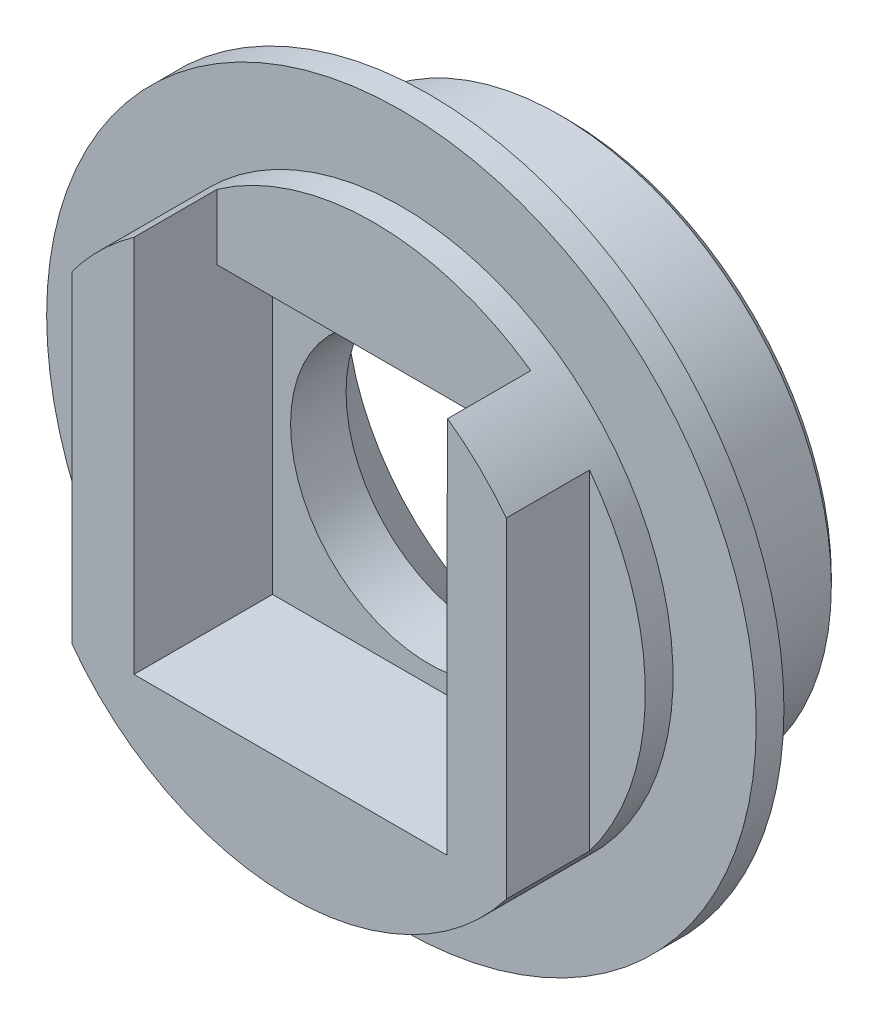
ISO-10303-21;
HEADER;
FILE_DESCRIPTION(('STEP AP214'),'2;1');
FILE_NAME('part.step','',(''),(''),'','','');
FILE_SCHEMA(('AUTOMOTIVE_DESIGN { 1 0 10303 214 1 1 1 1 }'));
ENDSEC;
DATA;
#1=APPLICATION_CONTEXT('core data for automotive mechanical design processes');
#2=APPLICATION_PROTOCOL_DEFINITION('international standard','automotive_design',2000,#1);
#3=PRODUCT_CONTEXT('',#1,'mechanical');
#4=PRODUCT('Part','Part','',(#3));
#5=PRODUCT_RELATED_PRODUCT_CATEGORY('part','',(#4));
#6=PRODUCT_DEFINITION_FORMATION('','',#4);
#7=PRODUCT_DEFINITION_CONTEXT('part definition',#1,'design');
#8=PRODUCT_DEFINITION('design','',#6,#7);
#9=PRODUCT_DEFINITION_SHAPE('','',#8);
#10=(LENGTH_UNIT() NAMED_UNIT(*) SI_UNIT(.MILLI.,.METRE.));
#11=(NAMED_UNIT(*) PLANE_ANGLE_UNIT() SI_UNIT($,.RADIAN.));
#12=(NAMED_UNIT(*) SI_UNIT($,.STERADIAN.) SOLID_ANGLE_UNIT());
#13=UNCERTAINTY_MEASURE_WITH_UNIT(LENGTH_MEASURE(1.E-05),#10,'distance_accuracy_value','');
#14=(GEOMETRIC_REPRESENTATION_CONTEXT(3) GLOBAL_UNCERTAINTY_ASSIGNED_CONTEXT((#13)) GLOBAL_UNIT_ASSIGNED_CONTEXT((#10,
#11,#12)) REPRESENTATION_CONTEXT('',''));
#15=CARTESIAN_POINT('',(0.,0.,0.));
#16=DIRECTION('',(0.,0.,1.));
#17=DIRECTION('',(1.,0.,0.));
#18=AXIS2_PLACEMENT_3D('',#15,#16,#17);
#19=CARTESIAN_POINT('',(0.,0.,10.));
#20=DIRECTION('',(0.,0.,-1.));
#21=DIRECTION('',(-1.,0.,0.));
#22=AXIS2_PLACEMENT_3D('',#19,#20,#21);
#23=CYLINDRICAL_SURFACE('',#22,9.8);
#24=CARTESIAN_POINT('',(0.,0.,10.));
#25=DIRECTION('',(0.,0.,1.));
#26=DIRECTION('',(1.,0.,0.));
#27=AXIS2_PLACEMENT_3D('',#24,#25,#26);
#28=CIRCLE('',#27,9.8);
#29=CARTESIAN_POINT('',(-7.8873957083092,-5.81626933184371,10.));
#30=VERTEX_POINT('',#29);
#31=CARTESIAN_POINT('',(7.78395445311825,-5.95399471546462,10.));
#32=VERTEX_POINT('',#31);
#33=EDGE_CURVE('E147',#30,#32,#28,.T.);
#34=ORIENTED_EDGE('',*,*,#33,.F.);
#35=DIRECTION('',(0.,0.,-1.));
#36=VECTOR('',#35,1.);
#37=CARTESIAN_POINT('',(-7.8873957083092,-5.81626933184371,10.));
#38=LINE('',#37,#36);
#39=CARTESIAN_POINT('',(-7.8873957083092,-5.81626933184371,7.));
#40=VERTEX_POINT('',#39);
#41=EDGE_CURVE('E180',#30,#40,#38,.T.);
#42=ORIENTED_EDGE('',*,*,#41,.T.);
#43=CARTESIAN_POINT('',(0.,0.,7.));
#44=DIRECTION('',(0.,0.,1.));
#45=DIRECTION('',(1.,0.,0.));
#46=AXIS2_PLACEMENT_3D('',#43,#44,#45);
#47=CIRCLE('',#46,9.8);
#48=CARTESIAN_POINT('',(-7.8873957083092,5.81626933184371,7.));
#49=VERTEX_POINT('',#48);
#50=EDGE_CURVE('E132',#49,#40,#47,.T.);
#51=ORIENTED_EDGE('',*,*,#50,.F.);
#52=DIRECTION('',(0.,0.,-1.));
#53=VECTOR('',#52,1.);
#54=CARTESIAN_POINT('',(-7.8873957083092,5.81626933184371,10.));
#55=LINE('',#54,#53);
#56=CARTESIAN_POINT('',(-7.8873957083092,5.81626933184371,10.));
#57=VERTEX_POINT('',#56);
#58=EDGE_CURVE('E172',#49,#57,#55,.F.);
#59=ORIENTED_EDGE('',*,*,#58,.T.);
#60=CARTESIAN_POINT('',(-5.65,8.00734038242412,10.));
#61=VERTEX_POINT('',#60);
#62=EDGE_CURVE('E156',#61,#57,#28,.T.);
#63=ORIENTED_EDGE('',*,*,#62,.F.);
#64=DIRECTION('',(0.,0.,-1.));
#65=VECTOR('',#64,1.);
#66=CARTESIAN_POINT('',(-5.65,8.00734038242412,10.));
#67=LINE('',#66,#65);
#68=CARTESIAN_POINT('',(-5.65,8.00734038242412,7.));
#69=VERTEX_POINT('',#68);
#70=EDGE_CURVE('E168',#61,#69,#67,.T.);
#71=ORIENTED_EDGE('',*,*,#70,.T.);
#72=CARTESIAN_POINT('',(0.,0.,7.));
#73=DIRECTION('',(0.,0.,-1.));
#74=DIRECTION('',(-1.,0.,0.));
#75=AXIS2_PLACEMENT_3D('',#72,#73,#74);
#76=CIRCLE('',#75,9.8);
#77=CARTESIAN_POINT('',(5.66340872170398,7.99786231757758,7.));
#78=VERTEX_POINT('',#77);
#79=EDGE_CURVE('E162',#69,#78,#76,.T.);
#80=ORIENTED_EDGE('',*,*,#79,.T.);
#81=DIRECTION('',(0.,0.,-1.));
#82=VECTOR('',#81,1.);
#83=CARTESIAN_POINT('',(5.66340872170398,7.99786231757758,10.));
#84=LINE('',#83,#82);
#85=CARTESIAN_POINT('',(5.66340872170398,7.99786231757758,10.));
#86=VERTEX_POINT('',#85);
#87=EDGE_CURVE('E151',#78,#86,#84,.F.);
#88=ORIENTED_EDGE('',*,*,#87,.T.);
#89=CARTESIAN_POINT('',(7.78395445311825,5.95399471546462,10.));
#90=VERTEX_POINT('',#89);
#91=EDGE_CURVE('E141',#90,#86,#28,.T.);
#92=ORIENTED_EDGE('',*,*,#91,.F.);
#93=DIRECTION('',(0.,0.,-1.));
#94=VECTOR('',#93,1.);
#95=CARTESIAN_POINT('',(7.78395445311825,5.95399471546462,10.));
#96=LINE('',#95,#94);
#97=CARTESIAN_POINT('',(7.78395445311825,5.95399471546462,7.));
#98=VERTEX_POINT('',#97);
#99=EDGE_CURVE('E130',#90,#98,#96,.T.);
#100=ORIENTED_EDGE('',*,*,#99,.T.);
#101=CARTESIAN_POINT('',(0.,0.,7.));
#102=DIRECTION('',(0.,0.,-1.));
#103=DIRECTION('',(-1.,0.,0.));
#104=AXIS2_PLACEMENT_3D('',#101,#102,#103);
#105=CIRCLE('',#104,9.8);
#106=CARTESIAN_POINT('',(7.78395445311825,-5.95399471546462,7.));
#107=VERTEX_POINT('',#106);
#108=EDGE_CURVE('E167',#98,#107,#105,.T.);
#109=ORIENTED_EDGE('',*,*,#108,.T.);
#110=DIRECTION('',(0.,0.,-1.));
#111=VECTOR('',#110,1.);
#112=CARTESIAN_POINT('',(7.78395445311825,-5.95399471546462,10.));
#113=LINE('',#112,#111);
#114=EDGE_CURVE('E136',#107,#32,#113,.F.);
#115=ORIENTED_EDGE('',*,*,#114,.T.);
#116=EDGE_LOOP('',(#34,#42,#51,#59,#63,#71,#80,#88,#92,#100,#109,#115));
#117=FACE_BOUND('',#116,.T.);
#118=CARTESIAN_POINT('',(0.,0.,6.));
#119=DIRECTION('',(0.,0.,-1.));
#120=DIRECTION('',(-1.,0.,0.));
#121=AXIS2_PLACEMENT_3D('',#118,#119,#120);
#122=CIRCLE('',#121,9.8);
#123=CARTESIAN_POINT('',(-9.8,0.,6.));
#124=VERTEX_POINT('',#123);
#125=EDGE_CURVE('E11',#124,#124,#122,.T.);
#126=ORIENTED_EDGE('',*,*,#125,.F.);
#127=EDGE_LOOP('',(#126));
#128=FACE_BOUND('',#127,.T.);
#129=ADVANCED_FACE('F41',(#117,#128),#23,.T.);
#130=CARTESIAN_POINT('',(-5.65,5.65,5.));
#131=DIRECTION('',(0.,1.,0.));
#132=DIRECTION('',(0.,0.,1.));
#133=AXIS2_PLACEMENT_3D('',#130,#131,#132);
#134=PLANE('',#133);
#135=DIRECTION('',(1.,0.,0.));
#136=VECTOR('',#135,1.);
#137=CARTESIAN_POINT('',(-5.65,5.65,7.));
#138=LINE('',#137,#136);
#139=CARTESIAN_POINT('',(-5.65,5.65,7.));
#140=VERTEX_POINT('',#139);
#141=CARTESIAN_POINT('',(5.65,5.65,7.));
#142=VERTEX_POINT('',#141);
#143=EDGE_CURVE('E398',#140,#142,#138,.T.);
#144=ORIENTED_EDGE('',*,*,#143,.F.);
#145=DIRECTION('',(0.,0.,1.));
#146=VECTOR('',#145,1.);
#147=CARTESIAN_POINT('',(-5.65,5.65,5.));
#148=LINE('',#147,#146);
#149=CARTESIAN_POINT('',(-5.65,5.65,5.));
#150=VERTEX_POINT('',#149);
#151=EDGE_CURVE('E157',#150,#140,#148,.T.);
#152=ORIENTED_EDGE('',*,*,#151,.F.);
#153=DIRECTION('',(-1.,0.,0.));
#154=VECTOR('',#153,1.);
#155=CARTESIAN_POINT('',(-5.65,5.65,5.));
#156=LINE('',#155,#154);
#157=CARTESIAN_POINT('',(5.65,5.65,5.));
#158=VERTEX_POINT('',#157);
#159=EDGE_CURVE('E381',#158,#150,#156,.T.);
#160=ORIENTED_EDGE('',*,*,#159,.F.);
#161=DIRECTION('',(0.,0.,1.));
#162=VECTOR('',#161,1.);
#163=CARTESIAN_POINT('',(5.65,5.65,5.));
#164=LINE('',#163,#162);
#165=EDGE_CURVE('E359',#158,#142,#164,.T.);
#166=ORIENTED_EDGE('',*,*,#165,.T.);
#167=EDGE_LOOP('',(#144,#152,#160,#166));
#168=FACE_BOUND('',#167,.T.);
#169=ADVANCED_FACE('F218',(#168),#134,.F.);
#170=CARTESIAN_POINT('',(0.,0.,10.));
#171=DIRECTION('',(0.,0.,-1.));
#172=DIRECTION('',(-1.,0.,0.));
#173=AXIS2_PLACEMENT_3D('',#170,#171,#172);
#174=CYLINDRICAL_SURFACE('',#173,5.);
#175=CARTESIAN_POINT('',(0.,0.,3.00000000000001));
#176=DIRECTION('',(0.,0.,1.));
#177=DIRECTION('',(1.,0.,0.));
#178=AXIS2_PLACEMENT_3D('',#175,#176,#177);
#179=CIRCLE('',#178,5.);
#180=CARTESIAN_POINT('',(5.,0.,3.00000000000001));
#181=VERTEX_POINT('',#180);
#182=EDGE_CURVE('E182',#181,#181,#179,.F.);
#183=ORIENTED_EDGE('',*,*,#182,.T.);
#184=EDGE_LOOP('',(#183));
#185=FACE_BOUND('',#184,.T.);
#186=CARTESIAN_POINT('',(0.,0.,5.));
#187=DIRECTION('',(0.,0.,1.));
#188=DIRECTION('',(1.,0.,0.));
#189=AXIS2_PLACEMENT_3D('',#186,#187,#188);
#190=CIRCLE('',#189,5.);
#191=CARTESIAN_POINT('',(5.,0.,5.));
#192=VERTEX_POINT('',#191);
#193=EDGE_CURVE('E154',#192,#192,#190,.T.);
#194=ORIENTED_EDGE('',*,*,#193,.T.);
#195=EDGE_LOOP('',(#194));
#196=FACE_BOUND('',#195,.T.);
#197=ADVANCED_FACE('F217',(#185,#196),#174,.F.);
#198=CARTESIAN_POINT('',(0.,0.,10.));
#199=DIRECTION('',(0.,0.,1.));
#200=DIRECTION('',(1.,0.,0.));
#201=AXIS2_PLACEMENT_3D('',#198,#199,#200);
#202=PLANE('',#201);
#203=DIRECTION('',(0.,1.,0.));
#204=VECTOR('',#203,1.);
#205=CARTESIAN_POINT('',(-7.8873957083092,9.03817967230844,10.));
#206=LINE('',#205,#204);
#207=EDGE_CURVE('E150',#30,#57,#206,.T.);
#208=ORIENTED_EDGE('',*,*,#207,.F.);
#209=ORIENTED_EDGE('',*,*,#33,.T.);
#210=DIRECTION('',(0.,-1.,0.));
#211=VECTOR('',#210,1.);
#212=CARTESIAN_POINT('',(7.78395445311825,9.03817967230844,10.));
#213=LINE('',#212,#211);
#214=EDGE_CURVE('E128',#90,#32,#213,.T.);
#215=ORIENTED_EDGE('',*,*,#214,.F.);
#216=ORIENTED_EDGE('',*,*,#91,.T.);
#217=DIRECTION('',(0.,1.,0.));
#218=VECTOR('',#217,1.);
#219=CARTESIAN_POINT('',(5.66340872170398,5.65,10.));
#220=LINE('',#219,#218);
#221=CARTESIAN_POINT('',(5.66340872170398,5.65,10.));
#222=VERTEX_POINT('',#221);
#223=EDGE_CURVE('E366',#222,#86,#220,.T.);
#224=ORIENTED_EDGE('',*,*,#223,.F.);
#225=DIRECTION('',(1.,0.,0.));
#226=VECTOR('',#225,1.);
#227=CARTESIAN_POINT('',(-5.65,5.65,10.));
#228=LINE('',#227,#226);
#229=CARTESIAN_POINT('',(5.65,5.65,10.));
#230=VERTEX_POINT('',#229);
#231=EDGE_CURVE('E353',#230,#222,#228,.T.);
#232=ORIENTED_EDGE('',*,*,#231,.F.);
#233=DIRECTION('',(0.,1.,0.));
#234=VECTOR('',#233,1.);
#235=CARTESIAN_POINT('',(5.65,5.65,10.));
#236=LINE('',#235,#234);
#237=CARTESIAN_POINT('',(5.65,-5.65,10.));
#238=VERTEX_POINT('',#237);
#239=EDGE_CURVE('E362',#238,#230,#236,.T.);
#240=ORIENTED_EDGE('',*,*,#239,.F.);
#241=DIRECTION('',(1.,0.,0.));
#242=VECTOR('',#241,1.);
#243=CARTESIAN_POINT('',(-5.65,-5.65,10.));
#244=LINE('',#243,#242);
#245=CARTESIAN_POINT('',(-5.65,-5.65,10.));
#246=VERTEX_POINT('',#245);
#247=EDGE_CURVE('E371',#246,#238,#244,.T.);
#248=ORIENTED_EDGE('',*,*,#247,.F.);
#249=DIRECTION('',(0.,-1.,0.));
#250=VECTOR('',#249,1.);
#251=CARTESIAN_POINT('',(-5.65,5.65,10.));
#252=LINE('',#251,#250);
#253=EDGE_CURVE('E376',#61,#246,#252,.T.);
#254=ORIENTED_EDGE('',*,*,#253,.F.);
#255=ORIENTED_EDGE('',*,*,#62,.T.);
#256=EDGE_LOOP('',(#208,#209,#215,#216,#224,#232,#240,#248,#254,#255));
#257=FACE_BOUND('',#256,.T.);
#258=ADVANCED_FACE('F142',(#257),#202,.T.);
#259=CARTESIAN_POINT('',(0.,0.,0.));
#260=DIRECTION('',(0.,0.,1.));
#261=DIRECTION('',(1.,0.,0.));
#262=AXIS2_PLACEMENT_3D('',#259,#260,#261);
#263=PLANE('',#262);
#264=CARTESIAN_POINT('',(0.,0.,0.));
#265=DIRECTION('',(0.,0.,1.));
#266=DIRECTION('',(1.,0.,0.));
#267=AXIS2_PLACEMENT_3D('',#264,#265,#266);
#268=CIRCLE('',#267,9.51);
#269=CARTESIAN_POINT('',(9.51,0.,0.));
#270=VERTEX_POINT('',#269);
#271=EDGE_CURVE('E49',#270,#270,#268,.F.);
#272=ORIENTED_EDGE('',*,*,#271,.T.);
#273=EDGE_LOOP('',(#272));
#274=FACE_BOUND('',#273,.T.);
#275=CARTESIAN_POINT('',(0.,0.,0.));
#276=DIRECTION('',(0.,0.,1.));
#277=DIRECTION('',(1.,0.,0.));
#278=AXIS2_PLACEMENT_3D('',#275,#276,#277);
#279=CIRCLE('',#278,8.);
#280=CARTESIAN_POINT('',(8.,0.,0.));
#281=VERTEX_POINT('',#280);
#282=EDGE_CURVE('E179',#281,#281,#279,.T.);
#283=ORIENTED_EDGE('',*,*,#282,.T.);
#284=EDGE_LOOP('',(#283));
#285=FACE_BOUND('',#284,.T.);
#286=ADVANCED_FACE('F192',(#274,#285),#263,.F.);
#287=CARTESIAN_POINT('',(0.,0.,5.));
#288=DIRECTION('',(0.,0.,-1.));
#289=DIRECTION('',(-1.,0.,0.));
#290=AXIS2_PLACEMENT_3D('',#287,#288,#289);
#291=CIRCLE('',#290,9.80000000000001);
#292=CARTESIAN_POINT('',(-9.80000000000001,0.,5.));
#293=VERTEX_POINT('',#292);
#294=EDGE_CURVE('E418',#293,#293,#291,.T.);
#295=ORIENTED_EDGE('',*,*,#294,.T.);
#296=EDGE_LOOP('',(#295));
#297=FACE_BOUND('',#296,.T.);
#298=CARTESIAN_POINT('',(0.,0.,0.29));
#299=DIRECTION('',(0.,0.,1.));
#300=DIRECTION('',(1.,0.,0.));
#301=AXIS2_PLACEMENT_3D('',#298,#299,#300);
#302=CIRCLE('',#301,9.8);
#303=CARTESIAN_POINT('',(9.8,0.,0.29));
#304=VERTEX_POINT('',#303);
#305=EDGE_CURVE('E187',#304,#304,#302,.T.);
#306=ORIENTED_EDGE('',*,*,#305,.T.);
#307=EDGE_LOOP('',(#306));
#308=FACE_BOUND('',#307,.T.);
#309=ADVANCED_FACE('F197',(#297,#308),#23,.T.);
#310=CARTESIAN_POINT('',(-5.65,5.65,5.));
#311=DIRECTION('',(-1.,0.,0.));
#312=DIRECTION('',(0.,0.,1.));
#313=AXIS2_PLACEMENT_3D('',#310,#311,#312);
#314=PLANE('',#313);
#315=ORIENTED_EDGE('',*,*,#253,.T.);
#316=DIRECTION('',(0.,0.,1.));
#317=VECTOR('',#316,1.);
#318=CARTESIAN_POINT('',(-5.65,-5.65,5.));
#319=LINE('',#318,#317);
#320=CARTESIAN_POINT('',(-5.65,-5.65,5.));
#321=VERTEX_POINT('',#320);
#322=EDGE_CURVE('E385',#321,#246,#319,.T.);
#323=ORIENTED_EDGE('',*,*,#322,.F.);
#324=DIRECTION('',(0.,-1.,0.));
#325=VECTOR('',#324,1.);
#326=CARTESIAN_POINT('',(-5.65,5.65,5.));
#327=LINE('',#326,#325);
#328=EDGE_CURVE('E369',#150,#321,#327,.T.);
#329=ORIENTED_EDGE('',*,*,#328,.F.);
#330=ORIENTED_EDGE('',*,*,#151,.T.);
#331=DIRECTION('',(0.,-1.,0.));
#332=VECTOR('',#331,1.);
#333=CARTESIAN_POINT('',(-5.65,5.65,7.));
#334=LINE('',#333,#332);
#335=EDGE_CURVE('E403',#69,#140,#334,.T.);
#336=ORIENTED_EDGE('',*,*,#335,.F.);
#337=ORIENTED_EDGE('',*,*,#70,.F.);
#338=EDGE_LOOP('',(#315,#323,#329,#330,#336,#337));
#339=FACE_BOUND('',#338,.T.);
#340=ADVANCED_FACE('F205',(#339),#314,.F.);
#341=CARTESIAN_POINT('',(5.65,5.65,5.));
#342=DIRECTION('',(1.,0.,0.));
#343=DIRECTION('',(0.,1.,0.));
#344=AXIS2_PLACEMENT_3D('',#341,#342,#343);
#345=PLANE('',#344);
#346=ORIENTED_EDGE('',*,*,#239,.T.);
#347=EDGE_CURVE('E351',#142,#230,#164,.T.);
#348=ORIENTED_EDGE('',*,*,#347,.F.);
#349=ORIENTED_EDGE('',*,*,#165,.F.);
#350=DIRECTION('',(0.,1.,0.));
#351=VECTOR('',#350,1.);
#352=CARTESIAN_POINT('',(5.65,5.65,5.));
#353=LINE('',#352,#351);
#354=CARTESIAN_POINT('',(5.65,-5.65,5.));
#355=VERTEX_POINT('',#354);
#356=EDGE_CURVE('E390',#355,#158,#353,.T.);
#357=ORIENTED_EDGE('',*,*,#356,.F.);
#358=DIRECTION('',(0.,0.,1.));
#359=VECTOR('',#358,1.);
#360=CARTESIAN_POINT('',(5.65,-5.65,5.));
#361=LINE('',#360,#359);
#362=EDGE_CURVE('E363',#355,#238,#361,.T.);
#363=ORIENTED_EDGE('',*,*,#362,.T.);
#364=EDGE_LOOP('',(#346,#348,#349,#357,#363));
#365=FACE_BOUND('',#364,.T.);
#366=ADVANCED_FACE('F208',(#365),#345,.F.);
#367=CARTESIAN_POINT('',(-5.65,-5.65,5.));
#368=DIRECTION('',(0.,-1.,0.));
#369=DIRECTION('',(0.,0.,-1.));
#370=AXIS2_PLACEMENT_3D('',#367,#368,#369);
#371=PLANE('',#370);
#372=ORIENTED_EDGE('',*,*,#247,.T.);
#373=ORIENTED_EDGE('',*,*,#362,.F.);
#374=DIRECTION('',(1.,0.,0.));
#375=VECTOR('',#374,1.);
#376=CARTESIAN_POINT('',(-5.65,-5.65,5.));
#377=LINE('',#376,#375);
#378=EDGE_CURVE('E372',#321,#355,#377,.T.);
#379=ORIENTED_EDGE('',*,*,#378,.F.);
#380=ORIENTED_EDGE('',*,*,#322,.T.);
#381=EDGE_LOOP('',(#372,#373,#379,#380));
#382=FACE_BOUND('',#381,.T.);
#383=ADVANCED_FACE('F236',(#382),#371,.F.);
#384=CARTESIAN_POINT('',(0.,0.,5.));
#385=DIRECTION('',(0.,0.,1.));
#386=DIRECTION('',(1.,0.,0.));
#387=AXIS2_PLACEMENT_3D('',#384,#385,#386);
#388=PLANE('',#387);
#389=ORIENTED_EDGE('',*,*,#193,.F.);
#390=EDGE_LOOP('',(#389));
#391=FACE_BOUND('',#390,.T.);
#392=ORIENTED_EDGE('',*,*,#328,.T.);
#393=ORIENTED_EDGE('',*,*,#378,.T.);
#394=ORIENTED_EDGE('',*,*,#356,.T.);
#395=ORIENTED_EDGE('',*,*,#159,.T.);
#396=EDGE_LOOP('',(#392,#393,#394,#395));
#397=FACE_BOUND('',#396,.T.);
#398=ADVANCED_FACE('F235',(#391,#397),#388,.T.);
#399=CARTESIAN_POINT('',(5.66340872170398,5.65,7.));
#400=DIRECTION('',(1.,0.,0.));
#401=DIRECTION('',(0.,0.,-1.));
#402=AXIS2_PLACEMENT_3D('',#399,#400,#401);
#403=PLANE('',#402);
#404=DIRECTION('',(0.,1.,0.));
#405=VECTOR('',#404,1.);
#406=CARTESIAN_POINT('',(5.66340872170398,5.65,7.));
#407=LINE('',#406,#405);
#408=CARTESIAN_POINT('',(5.66340872170398,5.65,7.));
#409=VERTEX_POINT('',#408);
#410=EDGE_CURVE('E396',#409,#78,#407,.T.);
#411=ORIENTED_EDGE('',*,*,#410,.F.);
#412=DIRECTION('',(0.,0.,1.));
#413=VECTOR('',#412,1.);
#414=CARTESIAN_POINT('',(5.66340872170398,5.65,7.));
#415=LINE('',#414,#413);
#416=EDGE_CURVE('E394',#409,#222,#415,.T.);
#417=ORIENTED_EDGE('',*,*,#416,.T.);
#418=ORIENTED_EDGE('',*,*,#223,.T.);
#419=ORIENTED_EDGE('',*,*,#87,.F.);
#420=EDGE_LOOP('',(#411,#417,#418,#419));
#421=FACE_BOUND('',#420,.T.);
#422=ADVANCED_FACE('F343',(#421),#403,.F.);
#423=CARTESIAN_POINT('',(0.,0.,7.));
#424=DIRECTION('',(0.,0.,-1.));
#425=DIRECTION('',(-1.,0.,0.));
#426=AXIS2_PLACEMENT_3D('',#423,#424,#425);
#427=PLANE('',#426);
#428=ORIENTED_EDGE('',*,*,#335,.T.);
#429=ORIENTED_EDGE('',*,*,#143,.T.);
#430=EDGE_CURVE('E358',#142,#409,#138,.T.);
#431=ORIENTED_EDGE('',*,*,#430,.T.);
#432=ORIENTED_EDGE('',*,*,#410,.T.);
#433=ORIENTED_EDGE('',*,*,#79,.F.);
#434=EDGE_LOOP('',(#428,#429,#431,#432,#433));
#435=FACE_BOUND('',#434,.T.);
#436=ADVANCED_FACE('F344',(#435),#427,.F.);
#437=CARTESIAN_POINT('',(-5.65,5.65,7.));
#438=DIRECTION('',(0.,-1.,0.));
#439=DIRECTION('',(0.,0.,-1.));
#440=AXIS2_PLACEMENT_3D('',#437,#438,#439);
#441=PLANE('',#440);
#442=ORIENTED_EDGE('',*,*,#347,.T.);
#443=ORIENTED_EDGE('',*,*,#231,.T.);
#444=ORIENTED_EDGE('',*,*,#416,.F.);
#445=ORIENTED_EDGE('',*,*,#430,.F.);
#446=EDGE_LOOP('',(#442,#443,#444,#445));
#447=FACE_BOUND('',#446,.T.);
#448=ADVANCED_FACE('F249',(#447),#441,.F.);
#449=CARTESIAN_POINT('',(7.78395445311825,9.03817967230844,7.));
#450=DIRECTION('',(-1.,0.,0.));
#451=DIRECTION('',(0.,0.,1.));
#452=AXIS2_PLACEMENT_3D('',#449,#450,#451);
#453=PLANE('',#452);
#454=ORIENTED_EDGE('',*,*,#214,.T.);
#455=ORIENTED_EDGE('',*,*,#114,.F.);
#456=DIRECTION('',(0.,-1.,0.));
#457=VECTOR('',#456,1.);
#458=CARTESIAN_POINT('',(7.78395445311825,9.03817967230844,7.));
#459=LINE('',#458,#457);
#460=EDGE_CURVE('E64',#98,#107,#459,.T.);
#461=ORIENTED_EDGE('',*,*,#460,.F.);
#462=ORIENTED_EDGE('',*,*,#99,.F.);
#463=EDGE_LOOP('',(#454,#455,#461,#462));
#464=FACE_BOUND('',#463,.T.);
#465=ADVANCED_FACE('F126',(#464),#453,.F.);
#466=CARTESIAN_POINT('',(0.,0.,7.));
#467=DIRECTION('',(0.,0.,-1.));
#468=DIRECTION('',(-1.,0.,0.));
#469=AXIS2_PLACEMENT_3D('',#466,#467,#468);
#470=PLANE('',#469);
#471=ORIENTED_EDGE('',*,*,#460,.T.);
#472=ORIENTED_EDGE('',*,*,#108,.F.);
#473=EDGE_LOOP('',(#471,#472));
#474=FACE_BOUND('',#473,.T.);
#475=ADVANCED_FACE('F260',(#474),#470,.F.);
#476=CARTESIAN_POINT('',(-7.8873957083092,9.03817967230844,7.));
#477=DIRECTION('',(1.,0.,0.));
#478=DIRECTION('',(0.,1.,0.));
#479=AXIS2_PLACEMENT_3D('',#476,#477,#478);
#480=PLANE('',#479);
#481=ORIENTED_EDGE('',*,*,#207,.T.);
#482=ORIENTED_EDGE('',*,*,#58,.F.);
#483=DIRECTION('',(0.,1.,0.));
#484=VECTOR('',#483,1.);
#485=CARTESIAN_POINT('',(-7.8873957083092,9.03817967230844,7.));
#486=LINE('',#485,#484);
#487=EDGE_CURVE('E57',#40,#49,#486,.T.);
#488=ORIENTED_EDGE('',*,*,#487,.F.);
#489=ORIENTED_EDGE('',*,*,#41,.F.);
#490=EDGE_LOOP('',(#481,#482,#488,#489));
#491=FACE_BOUND('',#490,.T.);
#492=ADVANCED_FACE('F262',(#491),#480,.F.);
#493=CARTESIAN_POINT('',(0.,0.,7.));
#494=DIRECTION('',(0.,0.,1.));
#495=DIRECTION('',(1.,0.,0.));
#496=AXIS2_PLACEMENT_3D('',#493,#494,#495);
#497=PLANE('',#496);
#498=ORIENTED_EDGE('',*,*,#50,.T.);
#499=ORIENTED_EDGE('',*,*,#487,.T.);
#500=EDGE_LOOP('',(#498,#499));
#501=FACE_BOUND('',#500,.T.);
#502=ADVANCED_FACE('F271',(#501),#497,.T.);
#503=CARTESIAN_POINT('',(0.,0.,0.));
#504=DIRECTION('',(0.,0.,-1.));
#505=DIRECTION('',(-1.,0.,0.));
#506=AXIS2_PLACEMENT_3D('',#503,#504,#505);
#507=CONICAL_SURFACE('',#506,8.,0.785398163397447);
#508=ORIENTED_EDGE('',*,*,#182,.F.);
#509=EDGE_LOOP('',(#508));
#510=FACE_BOUND('',#509,.T.);
#511=ORIENTED_EDGE('',*,*,#282,.F.);
#512=EDGE_LOOP('',(#511));
#513=FACE_BOUND('',#512,.T.);
#514=ADVANCED_FACE('F200',(#510,#513),#507,.F.);
#515=CARTESIAN_POINT('',(0.,0.,0.29));
#516=DIRECTION('',(0.,0.,1.));
#517=DIRECTION('',(1.,0.,0.));
#518=AXIS2_PLACEMENT_3D('',#515,#516,#517);
#519=CONICAL_SURFACE('',#518,9.8,0.785398163397457);
#520=ORIENTED_EDGE('',*,*,#271,.F.);
#521=EDGE_LOOP('',(#520));
#522=FACE_BOUND('',#521,.T.);
#523=ORIENTED_EDGE('',*,*,#305,.F.);
#524=EDGE_LOOP('',(#523));
#525=FACE_BOUND('',#524,.T.);
#526=ADVANCED_FACE('F42',(#522,#525),#519,.T.);
#527=CARTESIAN_POINT('',(0.,0.,6.));
#528=DIRECTION('',(0.,0.,-1.));
#529=DIRECTION('',(-1.,0.,0.));
#530=AXIS2_PLACEMENT_3D('',#527,#528,#529);
#531=CYLINDRICAL_SURFACE('',#530,12.8);
#532=CARTESIAN_POINT('',(0.,0.,6.));
#533=DIRECTION('',(0.,0.,-1.));
#534=DIRECTION('',(-1.,0.,0.));
#535=AXIS2_PLACEMENT_3D('',#532,#533,#534);
#536=CIRCLE('',#535,12.8);
#537=CARTESIAN_POINT('',(-12.8,0.,6.));
#538=VERTEX_POINT('',#537);
#539=EDGE_CURVE('E415',#538,#538,#536,.T.);
#540=ORIENTED_EDGE('',*,*,#539,.T.);
#541=EDGE_LOOP('',(#540));
#542=FACE_BOUND('',#541,.T.);
#543=CARTESIAN_POINT('',(0.,0.,5.));
#544=DIRECTION('',(0.,0.,-1.));
#545=DIRECTION('',(-1.,0.,0.));
#546=AXIS2_PLACEMENT_3D('',#543,#544,#545);
#547=CIRCLE('',#546,12.8);
#548=CARTESIAN_POINT('',(-12.8,0.,5.));
#549=VERTEX_POINT('',#548);
#550=EDGE_CURVE('E412',#549,#549,#547,.T.);
#551=ORIENTED_EDGE('',*,*,#550,.F.);
#552=EDGE_LOOP('',(#551));
#553=FACE_BOUND('',#552,.T.);
#554=ADVANCED_FACE('F198',(#542,#553),#531,.T.);
#555=CARTESIAN_POINT('',(0.,0.,6.));
#556=DIRECTION('',(0.,0.,-1.));
#557=DIRECTION('',(-1.,0.,0.));
#558=AXIS2_PLACEMENT_3D('',#555,#556,#557);
#559=PLANE('',#558);
#560=ORIENTED_EDGE('',*,*,#125,.T.);
#561=EDGE_LOOP('',(#560));
#562=FACE_BOUND('',#561,.T.);
#563=ORIENTED_EDGE('',*,*,#539,.F.);
#564=EDGE_LOOP('',(#563));
#565=FACE_BOUND('',#564,.T.);
#566=ADVANCED_FACE('F320',(#562,#565),#559,.F.);
#567=CARTESIAN_POINT('',(0.,0.,5.));
#568=DIRECTION('',(0.,0.,-1.));
#569=DIRECTION('',(-1.,0.,0.));
#570=AXIS2_PLACEMENT_3D('',#567,#568,#569);
#571=PLANE('',#570);
#572=ORIENTED_EDGE('',*,*,#294,.F.);
#573=EDGE_LOOP('',(#572));
#574=FACE_BOUND('',#573,.T.);
#575=ORIENTED_EDGE('',*,*,#550,.T.);
#576=EDGE_LOOP('',(#575));
#577=FACE_BOUND('',#576,.T.);
#578=ADVANCED_FACE('F330',(#574,#577),#571,.T.);
#579=CLOSED_SHELL('',(#129,#169,#197,#258,#286,#309,#340,#366,#383,#398,#422,#436,#448,#465,
#475,#492,#502,#514,#526,#554,#566,#578));
#580=MANIFOLD_SOLID_BREP('B2',#579);
#581=ADVANCED_BREP_SHAPE_REPRESENTATION('',(#18,#580),#14);
#582=SHAPE_DEFINITION_REPRESENTATION(#9,#581);
ENDSEC;
END-ISO-10303-21;
